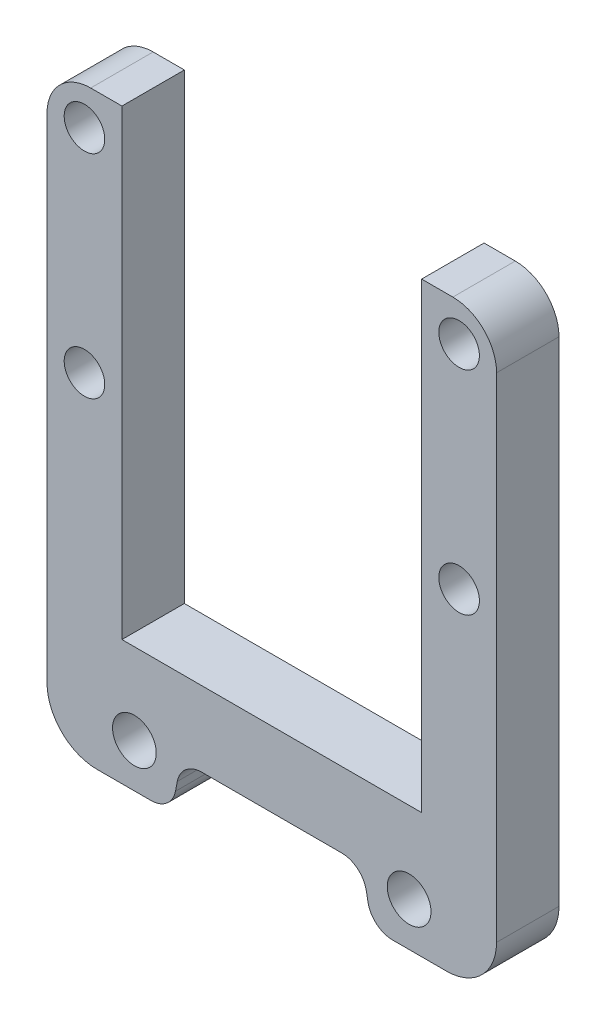
ISO-10303-21;
HEADER;
FILE_DESCRIPTION(('STEP AP214'),'2;1');
FILE_NAME('part.step','',(''),(''),'','','');
FILE_SCHEMA(('AUTOMOTIVE_DESIGN { 1 0 10303 214 1 1 1 1 }'));
ENDSEC;
DATA;
#1=APPLICATION_CONTEXT('core data for automotive mechanical design processes');
#2=APPLICATION_PROTOCOL_DEFINITION('international standard','automotive_design',2000,#1);
#3=PRODUCT_CONTEXT('',#1,'mechanical');
#4=PRODUCT('Part','Part','',(#3));
#5=PRODUCT_RELATED_PRODUCT_CATEGORY('part','',(#4));
#6=PRODUCT_DEFINITION_FORMATION('','',#4);
#7=PRODUCT_DEFINITION_CONTEXT('part definition',#1,'design');
#8=PRODUCT_DEFINITION('design','',#6,#7);
#9=PRODUCT_DEFINITION_SHAPE('','',#8);
#10=(LENGTH_UNIT() NAMED_UNIT(*) SI_UNIT(.MILLI.,.METRE.));
#11=(NAMED_UNIT(*) PLANE_ANGLE_UNIT() SI_UNIT($,.RADIAN.));
#12=(NAMED_UNIT(*) SI_UNIT($,.STERADIAN.) SOLID_ANGLE_UNIT());
#13=UNCERTAINTY_MEASURE_WITH_UNIT(LENGTH_MEASURE(1.E-05),#10,'distance_accuracy_value','');
#14=(GEOMETRIC_REPRESENTATION_CONTEXT(3) GLOBAL_UNCERTAINTY_ASSIGNED_CONTEXT((#13)) GLOBAL_UNIT_ASSIGNED_CONTEXT((#10,
#11,#12)) REPRESENTATION_CONTEXT('',''));
#15=CARTESIAN_POINT('',(0.,0.,0.));
#16=DIRECTION('',(0.,0.,1.));
#17=DIRECTION('',(1.,0.,0.));
#18=AXIS2_PLACEMENT_3D('',#15,#16,#17);
#19=CARTESIAN_POINT('',(0.,0.,10.));
#20=DIRECTION('',(0.,0.,1.));
#21=DIRECTION('',(1.,0.,0.));
#22=AXIS2_PLACEMENT_3D('',#19,#20,#21);
#23=PLANE('',#22);
#24=CARTESIAN_POINT('',(30.,104.,10.));
#25=DIRECTION('',(0.,0.,1.));
#26=DIRECTION('',(1.,0.,0.));
#27=AXIS2_PLACEMENT_3D('',#24,#25,#26);
#28=CIRCLE('',#27,3.24999999999999);
#29=CARTESIAN_POINT('',(33.25,104.,10.));
#30=VERTEX_POINT('',#29);
#31=EDGE_CURVE('E280',#30,#30,#28,.T.);
#32=ORIENTED_EDGE('',*,*,#31,.F.);
#33=EDGE_LOOP('',(#32));
#34=FACE_BOUND('',#33,.T.);
#35=DIRECTION('',(0.,1.,0.));
#36=VECTOR('',#35,1.);
#37=CARTESIAN_POINT('',(36.,16.,10.));
#38=LINE('',#37,#36);
#39=CARTESIAN_POINT('',(36.,24.,10.));
#40=VERTEX_POINT('',#39);
#41=CARTESIAN_POINT('',(36.,103.,10.));
#42=VERTEX_POINT('',#41);
#43=EDGE_CURVE('E316',#40,#42,#38,.T.);
#44=ORIENTED_EDGE('',*,*,#43,.T.);
#45=CARTESIAN_POINT('',(29.,103.,10.));
#46=DIRECTION('',(0.,0.,1.));
#47=DIRECTION('',(1.,0.,0.));
#48=AXIS2_PLACEMENT_3D('',#45,#46,#47);
#49=CIRCLE('',#48,7.);
#50=CARTESIAN_POINT('',(29.,110.,10.));
#51=VERTEX_POINT('',#50);
#52=EDGE_CURVE('E442',#42,#51,#49,.T.);
#53=ORIENTED_EDGE('',*,*,#52,.T.);
#54=DIRECTION('',(-1.,0.,0.));
#55=VECTOR('',#54,1.);
#56=CARTESIAN_POINT('',(36.,110.,10.));
#57=LINE('',#56,#55);
#58=CARTESIAN_POINT('',(24.,110.,10.));
#59=VERTEX_POINT('',#58);
#60=EDGE_CURVE('E296',#51,#59,#57,.T.);
#61=ORIENTED_EDGE('',*,*,#60,.T.);
#62=DIRECTION('',(0.,-1.,0.));
#63=VECTOR('',#62,1.);
#64=CARTESIAN_POINT('',(24.,110.,10.));
#65=LINE('',#64,#63);
#66=CARTESIAN_POINT('',(24.,36.,10.));
#67=VERTEX_POINT('',#66);
#68=EDGE_CURVE('E299',#59,#67,#65,.T.);
#69=ORIENTED_EDGE('',*,*,#68,.T.);
#70=DIRECTION('',(-1.,0.,0.));
#71=VECTOR('',#70,1.);
#72=CARTESIAN_POINT('',(24.,36.,10.));
#73=LINE('',#72,#71);
#74=CARTESIAN_POINT('',(-24.,36.,10.));
#75=VERTEX_POINT('',#74);
#76=EDGE_CURVE('E235',#67,#75,#73,.T.);
#77=ORIENTED_EDGE('',*,*,#76,.T.);
#78=DIRECTION('',(0.,-1.,0.));
#79=VECTOR('',#78,1.);
#80=CARTESIAN_POINT('',(-24.,110.,10.));
#81=LINE('',#80,#79);
#82=CARTESIAN_POINT('',(-24.,110.,10.));
#83=VERTEX_POINT('',#82);
#84=EDGE_CURVE('E219',#83,#75,#81,.T.);
#85=ORIENTED_EDGE('',*,*,#84,.F.);
#86=DIRECTION('',(1.,0.,0.));
#87=VECTOR('',#86,1.);
#88=CARTESIAN_POINT('',(-36.,110.,10.));
#89=LINE('',#88,#87);
#90=CARTESIAN_POINT('',(-29.,110.,10.));
#91=VERTEX_POINT('',#90);
#92=EDGE_CURVE('E213',#91,#83,#89,.T.);
#93=ORIENTED_EDGE('',*,*,#92,.F.);
#94=CARTESIAN_POINT('',(-29.,103.,10.));
#95=DIRECTION('',(0.,0.,1.));
#96=DIRECTION('',(1.,0.,0.));
#97=AXIS2_PLACEMENT_3D('',#94,#95,#96);
#98=CIRCLE('',#97,7.);
#99=CARTESIAN_POINT('',(-36.,103.,10.));
#100=VERTEX_POINT('',#99);
#101=EDGE_CURVE('E62',#91,#100,#98,.T.);
#102=ORIENTED_EDGE('',*,*,#101,.T.);
#103=DIRECTION('',(0.,1.,0.));
#104=VECTOR('',#103,1.);
#105=CARTESIAN_POINT('',(-36.,16.,10.));
#106=LINE('',#105,#104);
#107=CARTESIAN_POINT('',(-36.,24.,10.));
#108=VERTEX_POINT('',#107);
#109=EDGE_CURVE('E251',#108,#100,#106,.T.);
#110=ORIENTED_EDGE('',*,*,#109,.F.);
#111=CARTESIAN_POINT('',(-28.,24.,10.));
#112=DIRECTION('',(0.,0.,1.));
#113=DIRECTION('',(1.,0.,0.));
#114=AXIS2_PLACEMENT_3D('',#111,#112,#113);
#115=CIRCLE('',#114,8.);
#116=CARTESIAN_POINT('',(-28.,16.,10.));
#117=VERTEX_POINT('',#116);
#118=EDGE_CURVE('E418',#108,#117,#115,.T.);
#119=ORIENTED_EDGE('',*,*,#118,.T.);
#120=DIRECTION('',(-1.,0.,0.));
#121=VECTOR('',#120,1.);
#122=CARTESIAN_POINT('',(-16.0550424731017,16.,10.));
#123=LINE('',#122,#121);
#124=CARTESIAN_POINT('',(-19.3523880163717,16.,10.));
#125=VERTEX_POINT('',#124);
#126=EDGE_CURVE('E244',#125,#117,#123,.T.);
#127=ORIENTED_EDGE('',*,*,#126,.F.);
#128=CARTESIAN_POINT('',(-19.3523880163717,20.,10.));
#129=DIRECTION('',(0.,0.,1.));
#130=DIRECTION('',(1.,0.,0.));
#131=AXIS2_PLACEMENT_3D('',#128,#129,#130);
#132=CIRCLE('',#131,4.);
#133=CARTESIAN_POINT('',(-15.4258792825811,19.2367640184938,10.));
#134=VERTEX_POINT('',#133);
#135=EDGE_CURVE('E367',#125,#134,#132,.T.);
#136=ORIENTED_EDGE('',*,*,#135,.T.);
#137=DIRECTION('',(-0.190808995376542,-0.981627183447665,0.));
#138=VECTOR('',#137,1.);
#139=CARTESIAN_POINT('',(-14.5,24.,10.));
#140=LINE('',#139,#138);
#141=CARTESIAN_POINT('',(-15.1291631905207,20.7632359815062,10.));
#142=VERTEX_POINT('',#141);
#143=EDGE_CURVE('E238',#142,#134,#140,.T.);
#144=ORIENTED_EDGE('',*,*,#143,.F.);
#145=CARTESIAN_POINT('',(-11.20265445673,20.,10.));
#146=DIRECTION('',(0.,0.,1.));
#147=DIRECTION('',(1.,0.,0.));
#148=AXIS2_PLACEMENT_3D('',#145,#146,#147);
#149=CIRCLE('',#148,4.);
#150=CARTESIAN_POINT('',(-11.20265445673,24.,10.));
#151=VERTEX_POINT('',#150);
#152=EDGE_CURVE('E393',#142,#151,#149,.F.);
#153=ORIENTED_EDGE('',*,*,#152,.T.);
#154=DIRECTION('',(1.,0.,0.));
#155=VECTOR('',#154,1.);
#156=CARTESIAN_POINT('',(0.,24.,10.));
#157=LINE('',#156,#155);
#158=CARTESIAN_POINT('',(11.20265445673,24.,10.));
#159=VERTEX_POINT('',#158);
#160=EDGE_CURVE('E304',#151,#159,#157,.T.);
#161=ORIENTED_EDGE('',*,*,#160,.T.);
#162=CARTESIAN_POINT('',(11.20265445673,20.,10.));
#163=DIRECTION('',(0.,0.,1.));
#164=DIRECTION('',(1.,0.,0.));
#165=AXIS2_PLACEMENT_3D('',#162,#163,#164);
#166=CIRCLE('',#165,4.);
#167=CARTESIAN_POINT('',(15.1291631905207,20.7632359815062,10.));
#168=VERTEX_POINT('',#167);
#169=EDGE_CURVE('E399',#159,#168,#166,.F.);
#170=ORIENTED_EDGE('',*,*,#169,.T.);
#171=DIRECTION('',(0.190808995376542,-0.981627183447665,0.));
#172=VECTOR('',#171,1.);
#173=CARTESIAN_POINT('',(14.5,24.,10.));
#174=LINE('',#173,#172);
#175=CARTESIAN_POINT('',(15.4258792825811,19.2367640184938,10.));
#176=VERTEX_POINT('',#175);
#177=EDGE_CURVE('E308',#168,#176,#174,.T.);
#178=ORIENTED_EDGE('',*,*,#177,.T.);
#179=CARTESIAN_POINT('',(19.3523880163717,20.,10.));
#180=DIRECTION('',(0.,0.,1.));
#181=DIRECTION('',(1.,0.,0.));
#182=AXIS2_PLACEMENT_3D('',#179,#180,#181);
#183=CIRCLE('',#182,4.);
#184=CARTESIAN_POINT('',(19.3523880163717,16.,10.));
#185=VERTEX_POINT('',#184);
#186=EDGE_CURVE('E370',#176,#185,#183,.T.);
#187=ORIENTED_EDGE('',*,*,#186,.T.);
#188=DIRECTION('',(1.,0.,0.));
#189=VECTOR('',#188,1.);
#190=CARTESIAN_POINT('',(16.0550424731017,16.,10.));
#191=LINE('',#190,#189);
#192=CARTESIAN_POINT('',(28.,16.,10.));
#193=VERTEX_POINT('',#192);
#194=EDGE_CURVE('E312',#185,#193,#191,.T.);
#195=ORIENTED_EDGE('',*,*,#194,.T.);
#196=CARTESIAN_POINT('',(28.,24.,10.));
#197=DIRECTION('',(0.,0.,1.));
#198=DIRECTION('',(1.,0.,0.));
#199=AXIS2_PLACEMENT_3D('',#196,#197,#198);
#200=CIRCLE('',#199,8.);
#201=EDGE_CURVE('E415',#193,#40,#200,.T.);
#202=ORIENTED_EDGE('',*,*,#201,.T.);
#203=EDGE_LOOP('',(#44,#53,#61,#69,#77,#85,#93,#102,#110,#119,#127,#136,#144,#153,#161,#170,
#178,#187,#195,#202));
#204=FACE_BOUND('',#203,.T.);
#205=CARTESIAN_POINT('',(22.,23.,10.));
#206=DIRECTION('',(0.,0.,1.));
#207=DIRECTION('',(1.,0.,0.));
#208=AXIS2_PLACEMENT_3D('',#205,#206,#207);
#209=CIRCLE('',#208,3.5);
#210=CARTESIAN_POINT('',(25.5,23.,10.));
#211=VERTEX_POINT('',#210);
#212=EDGE_CURVE('E288',#211,#211,#209,.T.);
#213=ORIENTED_EDGE('',*,*,#212,.F.);
#214=EDGE_LOOP('',(#213));
#215=FACE_BOUND('',#214,.T.);
#216=CARTESIAN_POINT('',(30.,70.,10.));
#217=DIRECTION('',(0.,0.,1.));
#218=DIRECTION('',(1.,0.,0.));
#219=AXIS2_PLACEMENT_3D('',#216,#217,#218);
#220=CIRCLE('',#219,3.24999999999999);
#221=CARTESIAN_POINT('',(33.25,70.,10.));
#222=VERTEX_POINT('',#221);
#223=EDGE_CURVE('E272',#222,#222,#220,.T.);
#224=ORIENTED_EDGE('',*,*,#223,.F.);
#225=EDGE_LOOP('',(#224));
#226=FACE_BOUND('',#225,.T.);
#227=CARTESIAN_POINT('',(-30.,104.,10.));
#228=DIRECTION('',(0.,0.,-1.));
#229=DIRECTION('',(-1.,0.,0.));
#230=AXIS2_PLACEMENT_3D('',#227,#228,#229);
#231=CIRCLE('',#230,3.24999999999999);
#232=CARTESIAN_POINT('',(-33.25,104.,10.));
#233=VERTEX_POINT('',#232);
#234=EDGE_CURVE('E786',#233,#233,#231,.T.);
#235=ORIENTED_EDGE('',*,*,#234,.T.);
#236=EDGE_LOOP('',(#235));
#237=FACE_BOUND('',#236,.T.);
#238=CARTESIAN_POINT('',(-22.,23.,10.));
#239=DIRECTION('',(0.,0.,-1.));
#240=DIRECTION('',(-1.,0.,0.));
#241=AXIS2_PLACEMENT_3D('',#238,#239,#240);
#242=CIRCLE('',#241,3.5);
#243=CARTESIAN_POINT('',(-25.5,23.,10.));
#244=VERTEX_POINT('',#243);
#245=EDGE_CURVE('E257',#244,#244,#242,.T.);
#246=ORIENTED_EDGE('',*,*,#245,.T.);
#247=EDGE_LOOP('',(#246));
#248=FACE_BOUND('',#247,.T.);
#249=CARTESIAN_POINT('',(-30.,70.,10.));
#250=DIRECTION('',(0.,0.,-1.));
#251=DIRECTION('',(-1.,0.,0.));
#252=AXIS2_PLACEMENT_3D('',#249,#250,#251);
#253=CIRCLE('',#252,3.24999999999999);
#254=CARTESIAN_POINT('',(-33.25,70.,10.));
#255=VERTEX_POINT('',#254);
#256=EDGE_CURVE('E775',#255,#255,#253,.T.);
#257=ORIENTED_EDGE('',*,*,#256,.T.);
#258=EDGE_LOOP('',(#257));
#259=FACE_BOUND('',#258,.T.);
#260=ADVANCED_FACE('F41',(#34,#204,#215,#226,#237,#248,#259),#23,.T.);
#261=CARTESIAN_POINT('',(0.,0.,0.));
#262=DIRECTION('',(0.,0.,1.));
#263=DIRECTION('',(1.,0.,0.));
#264=AXIS2_PLACEMENT_3D('',#261,#262,#263);
#265=PLANE('',#264);
#266=DIRECTION('',(-1.,0.,0.));
#267=VECTOR('',#266,1.);
#268=CARTESIAN_POINT('',(36.,110.,0.));
#269=LINE('',#268,#267);
#270=CARTESIAN_POINT('',(29.,110.,0.));
#271=VERTEX_POINT('',#270);
#272=CARTESIAN_POINT('',(24.,110.,0.));
#273=VERTEX_POINT('',#272);
#274=EDGE_CURVE('E292',#271,#273,#269,.T.);
#275=ORIENTED_EDGE('',*,*,#274,.F.);
#276=CARTESIAN_POINT('',(29.,103.,0.));
#277=DIRECTION('',(0.,0.,1.));
#278=DIRECTION('',(1.,0.,0.));
#279=AXIS2_PLACEMENT_3D('',#276,#277,#278);
#280=CIRCLE('',#279,7.);
#281=CARTESIAN_POINT('',(36.,103.,0.));
#282=VERTEX_POINT('',#281);
#283=EDGE_CURVE('E435',#271,#282,#280,.F.);
#284=ORIENTED_EDGE('',*,*,#283,.T.);
#285=DIRECTION('',(0.,1.,0.));
#286=VECTOR('',#285,1.);
#287=CARTESIAN_POINT('',(36.,16.,0.));
#288=LINE('',#287,#286);
#289=CARTESIAN_POINT('',(36.,24.,0.));
#290=VERTEX_POINT('',#289);
#291=EDGE_CURVE('E300',#290,#282,#288,.T.);
#292=ORIENTED_EDGE('',*,*,#291,.F.);
#293=CARTESIAN_POINT('',(28.,24.,0.));
#294=DIRECTION('',(0.,0.,1.));
#295=DIRECTION('',(1.,0.,0.));
#296=AXIS2_PLACEMENT_3D('',#293,#294,#295);
#297=CIRCLE('',#296,8.);
#298=CARTESIAN_POINT('',(28.,16.,0.));
#299=VERTEX_POINT('',#298);
#300=EDGE_CURVE('E406',#290,#299,#297,.F.);
#301=ORIENTED_EDGE('',*,*,#300,.T.);
#302=DIRECTION('',(1.,0.,0.));
#303=VECTOR('',#302,1.);
#304=CARTESIAN_POINT('',(16.0550424731017,16.,0.));
#305=LINE('',#304,#303);
#306=CARTESIAN_POINT('',(19.3523880163717,16.,0.));
#307=VERTEX_POINT('',#306);
#308=EDGE_CURVE('E336',#307,#299,#305,.T.);
#309=ORIENTED_EDGE('',*,*,#308,.F.);
#310=CARTESIAN_POINT('',(19.3523880163717,20.,0.));
#311=DIRECTION('',(0.,0.,1.));
#312=DIRECTION('',(1.,0.,0.));
#313=AXIS2_PLACEMENT_3D('',#310,#311,#312);
#314=CIRCLE('',#313,4.);
#315=CARTESIAN_POINT('',(15.4258792825811,19.2367640184938,0.));
#316=VERTEX_POINT('',#315);
#317=EDGE_CURVE('E357',#307,#316,#314,.F.);
#318=ORIENTED_EDGE('',*,*,#317,.T.);
#319=DIRECTION('',(0.190808995376542,-0.981627183447665,0.));
#320=VECTOR('',#319,1.);
#321=CARTESIAN_POINT('',(14.5,24.,0.));
#322=LINE('',#321,#320);
#323=CARTESIAN_POINT('',(15.1291631905207,20.7632359815062,0.));
#324=VERTEX_POINT('',#323);
#325=EDGE_CURVE('E332',#324,#316,#322,.T.);
#326=ORIENTED_EDGE('',*,*,#325,.F.);
#327=CARTESIAN_POINT('',(11.20265445673,20.,0.));
#328=DIRECTION('',(0.,0.,1.));
#329=DIRECTION('',(1.,0.,0.));
#330=AXIS2_PLACEMENT_3D('',#327,#328,#329);
#331=CIRCLE('',#330,4.);
#332=CARTESIAN_POINT('',(11.20265445673,24.,0.));
#333=VERTEX_POINT('',#332);
#334=EDGE_CURVE('E396',#324,#333,#331,.T.);
#335=ORIENTED_EDGE('',*,*,#334,.T.);
#336=DIRECTION('',(1.,0.,0.));
#337=VECTOR('',#336,1.);
#338=CARTESIAN_POINT('',(0.,24.,0.));
#339=LINE('',#338,#337);
#340=CARTESIAN_POINT('',(-11.20265445673,24.,0.));
#341=VERTEX_POINT('',#340);
#342=EDGE_CURVE('E328',#341,#333,#339,.T.);
#343=ORIENTED_EDGE('',*,*,#342,.F.);
#344=CARTESIAN_POINT('',(-11.20265445673,20.,0.));
#345=DIRECTION('',(0.,0.,1.));
#346=DIRECTION('',(1.,0.,0.));
#347=AXIS2_PLACEMENT_3D('',#344,#345,#346);
#348=CIRCLE('',#347,4.);
#349=CARTESIAN_POINT('',(-15.1291631905207,20.7632359815062,0.));
#350=VERTEX_POINT('',#349);
#351=EDGE_CURVE('E390',#341,#350,#348,.T.);
#352=ORIENTED_EDGE('',*,*,#351,.T.);
#353=DIRECTION('',(-0.190808995376542,-0.981627183447665,0.));
#354=VECTOR('',#353,1.);
#355=CARTESIAN_POINT('',(-14.5,24.,0.));
#356=LINE('',#355,#354);
#357=CARTESIAN_POINT('',(-15.4258792825811,19.2367640184938,0.));
#358=VERTEX_POINT('',#357);
#359=EDGE_CURVE('E260',#350,#358,#356,.T.);
#360=ORIENTED_EDGE('',*,*,#359,.T.);
#361=CARTESIAN_POINT('',(-19.3523880163717,20.,0.));
#362=DIRECTION('',(0.,0.,1.));
#363=DIRECTION('',(1.,0.,0.));
#364=AXIS2_PLACEMENT_3D('',#361,#362,#363);
#365=CIRCLE('',#364,4.);
#366=CARTESIAN_POINT('',(-19.3523880163717,16.,0.));
#367=VERTEX_POINT('',#366);
#368=EDGE_CURVE('E354',#358,#367,#365,.F.);
#369=ORIENTED_EDGE('',*,*,#368,.T.);
#370=DIRECTION('',(-1.,0.,0.));
#371=VECTOR('',#370,1.);
#372=CARTESIAN_POINT('',(-16.0550424731017,16.,0.));
#373=LINE('',#372,#371);
#374=CARTESIAN_POINT('',(-28.,16.,0.));
#375=VERTEX_POINT('',#374);
#376=EDGE_CURVE('E264',#367,#375,#373,.T.);
#377=ORIENTED_EDGE('',*,*,#376,.T.);
#378=CARTESIAN_POINT('',(-28.,24.,0.));
#379=DIRECTION('',(0.,0.,1.));
#380=DIRECTION('',(1.,0.,0.));
#381=AXIS2_PLACEMENT_3D('',#378,#379,#380);
#382=CIRCLE('',#381,8.);
#383=CARTESIAN_POINT('',(-36.,24.,0.));
#384=VERTEX_POINT('',#383);
#385=EDGE_CURVE('E409',#375,#384,#382,.F.);
#386=ORIENTED_EDGE('',*,*,#385,.T.);
#387=DIRECTION('',(0.,1.,0.));
#388=VECTOR('',#387,1.);
#389=CARTESIAN_POINT('',(-36.,16.,0.));
#390=LINE('',#389,#388);
#391=CARTESIAN_POINT('',(-36.,103.,0.));
#392=VERTEX_POINT('',#391);
#393=EDGE_CURVE('E220',#384,#392,#390,.T.);
#394=ORIENTED_EDGE('',*,*,#393,.T.);
#395=CARTESIAN_POINT('',(-29.,103.,0.));
#396=DIRECTION('',(0.,0.,1.));
#397=DIRECTION('',(1.,0.,0.));
#398=AXIS2_PLACEMENT_3D('',#395,#396,#397);
#399=CIRCLE('',#398,7.);
#400=CARTESIAN_POINT('',(-29.,110.,0.));
#401=VERTEX_POINT('',#400);
#402=EDGE_CURVE('E432',#392,#401,#399,.F.);
#403=ORIENTED_EDGE('',*,*,#402,.T.);
#404=DIRECTION('',(1.,0.,0.));
#405=VECTOR('',#404,1.);
#406=CARTESIAN_POINT('',(-36.,110.,0.));
#407=LINE('',#406,#405);
#408=CARTESIAN_POINT('',(-24.,110.,0.));
#409=VERTEX_POINT('',#408);
#410=EDGE_CURVE('E254',#401,#409,#407,.T.);
#411=ORIENTED_EDGE('',*,*,#410,.T.);
#412=DIRECTION('',(0.,-1.,0.));
#413=VECTOR('',#412,1.);
#414=CARTESIAN_POINT('',(-24.,110.,0.));
#415=LINE('',#414,#413);
#416=CARTESIAN_POINT('',(-24.,36.,0.));
#417=VERTEX_POINT('',#416);
#418=EDGE_CURVE('E227',#409,#417,#415,.T.);
#419=ORIENTED_EDGE('',*,*,#418,.T.);
#420=DIRECTION('',(-1.,0.,0.));
#421=VECTOR('',#420,1.);
#422=CARTESIAN_POINT('',(24.,36.,0.));
#423=LINE('',#422,#421);
#424=CARTESIAN_POINT('',(24.,36.,0.));
#425=VERTEX_POINT('',#424);
#426=EDGE_CURVE('E325',#425,#417,#423,.T.);
#427=ORIENTED_EDGE('',*,*,#426,.F.);
#428=DIRECTION('',(0.,-1.,0.));
#429=VECTOR('',#428,1.);
#430=CARTESIAN_POINT('',(24.,110.,0.));
#431=LINE('',#430,#429);
#432=EDGE_CURVE('E322',#273,#425,#431,.T.);
#433=ORIENTED_EDGE('',*,*,#432,.F.);
#434=EDGE_LOOP('',(#275,#284,#292,#301,#309,#318,#326,#335,#343,#352,#360,#369,#377,#386,#394,
#403,#411,#419,#427,#433));
#435=FACE_BOUND('',#434,.T.);
#436=CARTESIAN_POINT('',(22.,23.,0.));
#437=DIRECTION('',(0.,0.,1.));
#438=DIRECTION('',(1.,0.,0.));
#439=AXIS2_PLACEMENT_3D('',#436,#437,#438);
#440=CIRCLE('',#439,3.5);
#441=CARTESIAN_POINT('',(25.5,23.,0.));
#442=VERTEX_POINT('',#441);
#443=EDGE_CURVE('E284',#442,#442,#440,.T.);
#444=ORIENTED_EDGE('',*,*,#443,.T.);
#445=EDGE_LOOP('',(#444));
#446=FACE_BOUND('',#445,.T.);
#447=CARTESIAN_POINT('',(30.,104.,0.));
#448=DIRECTION('',(0.,0.,1.));
#449=DIRECTION('',(1.,0.,0.));
#450=AXIS2_PLACEMENT_3D('',#447,#448,#449);
#451=CIRCLE('',#450,3.24999999999999);
#452=CARTESIAN_POINT('',(33.25,104.,0.));
#453=VERTEX_POINT('',#452);
#454=EDGE_CURVE('E276',#453,#453,#451,.T.);
#455=ORIENTED_EDGE('',*,*,#454,.T.);
#456=EDGE_LOOP('',(#455));
#457=FACE_BOUND('',#456,.T.);
#458=CARTESIAN_POINT('',(30.,70.,0.));
#459=DIRECTION('',(0.,0.,1.));
#460=DIRECTION('',(1.,0.,0.));
#461=AXIS2_PLACEMENT_3D('',#458,#459,#460);
#462=CIRCLE('',#461,3.24999999999999);
#463=CARTESIAN_POINT('',(33.25,70.,0.));
#464=VERTEX_POINT('',#463);
#465=EDGE_CURVE('E229',#464,#464,#462,.T.);
#466=ORIENTED_EDGE('',*,*,#465,.T.);
#467=EDGE_LOOP('',(#466));
#468=FACE_BOUND('',#467,.T.);
#469=CARTESIAN_POINT('',(-22.,23.,0.));
#470=DIRECTION('',(0.,0.,-1.));
#471=DIRECTION('',(-1.,0.,0.));
#472=AXIS2_PLACEMENT_3D('',#469,#470,#471);
#473=CIRCLE('',#472,3.5);
#474=CARTESIAN_POINT('',(-25.5,23.,0.));
#475=VERTEX_POINT('',#474);
#476=EDGE_CURVE('E789',#475,#475,#473,.T.);
#477=ORIENTED_EDGE('',*,*,#476,.F.);
#478=EDGE_LOOP('',(#477));
#479=FACE_BOUND('',#478,.T.);
#480=CARTESIAN_POINT('',(-30.,104.,0.));
#481=DIRECTION('',(0.,0.,-1.));
#482=DIRECTION('',(-1.,0.,0.));
#483=AXIS2_PLACEMENT_3D('',#480,#481,#482);
#484=CIRCLE('',#483,3.24999999999999);
#485=CARTESIAN_POINT('',(-33.25,104.,0.));
#486=VERTEX_POINT('',#485);
#487=EDGE_CURVE('E783',#486,#486,#484,.T.);
#488=ORIENTED_EDGE('',*,*,#487,.F.);
#489=EDGE_LOOP('',(#488));
#490=FACE_BOUND('',#489,.T.);
#491=CARTESIAN_POINT('',(-30.,70.,0.));
#492=DIRECTION('',(0.,0.,-1.));
#493=DIRECTION('',(-1.,0.,0.));
#494=AXIS2_PLACEMENT_3D('',#491,#492,#493);
#495=CIRCLE('',#494,3.24999999999999);
#496=CARTESIAN_POINT('',(-33.25,70.,0.));
#497=VERTEX_POINT('',#496);
#498=EDGE_CURVE('E778',#497,#497,#495,.T.);
#499=ORIENTED_EDGE('',*,*,#498,.F.);
#500=EDGE_LOOP('',(#499));
#501=FACE_BOUND('',#500,.T.);
#502=ADVANCED_FACE('F454',(#435,#446,#457,#468,#479,#490,#501),#265,.F.);
#503=CARTESIAN_POINT('',(36.,110.,10.));
#504=DIRECTION('',(0.,-1.,0.));
#505=DIRECTION('',(0.,0.,-1.));
#506=AXIS2_PLACEMENT_3D('',#503,#504,#505);
#507=PLANE('',#506);
#508=ORIENTED_EDGE('',*,*,#60,.F.);
#509=DIRECTION('',(0.,0.,-1.));
#510=VECTOR('',#509,1.);
#511=CARTESIAN_POINT('',(29.,110.,10.));
#512=LINE('',#511,#510);
#513=EDGE_CURVE('E428',#51,#271,#512,.T.);
#514=ORIENTED_EDGE('',*,*,#513,.T.);
#515=ORIENTED_EDGE('',*,*,#274,.T.);
#516=DIRECTION('',(0.,0.,-1.));
#517=VECTOR('',#516,1.);
#518=CARTESIAN_POINT('',(24.,110.,10.));
#519=LINE('',#518,#517);
#520=EDGE_CURVE('E346',#59,#273,#519,.T.);
#521=ORIENTED_EDGE('',*,*,#520,.F.);
#522=EDGE_LOOP('',(#508,#514,#515,#521));
#523=FACE_BOUND('',#522,.T.);
#524=ADVANCED_FACE('F517',(#523),#507,.F.);
#525=CARTESIAN_POINT('',(24.,110.,10.));
#526=DIRECTION('',(1.,0.,0.));
#527=DIRECTION('',(0.,1.,0.));
#528=AXIS2_PLACEMENT_3D('',#525,#526,#527);
#529=PLANE('',#528);
#530=ORIENTED_EDGE('',*,*,#432,.T.);
#531=DIRECTION('',(0.,0.,-1.));
#532=VECTOR('',#531,1.);
#533=CARTESIAN_POINT('',(24.,36.,10.));
#534=LINE('',#533,#532);
#535=EDGE_CURVE('E319',#67,#425,#534,.T.);
#536=ORIENTED_EDGE('',*,*,#535,.F.);
#537=ORIENTED_EDGE('',*,*,#68,.F.);
#538=ORIENTED_EDGE('',*,*,#520,.T.);
#539=EDGE_LOOP('',(#530,#536,#537,#538));
#540=FACE_BOUND('',#539,.T.);
#541=ADVANCED_FACE('F522',(#540),#529,.F.);
#542=CARTESIAN_POINT('',(24.,36.,10.));
#543=DIRECTION('',(0.,-1.,0.));
#544=DIRECTION('',(1.,0.,0.));
#545=AXIS2_PLACEMENT_3D('',#542,#543,#544);
#546=PLANE('',#545);
#547=ORIENTED_EDGE('',*,*,#426,.T.);
#548=DIRECTION('',(0.,0.,-1.));
#549=VECTOR('',#548,1.);
#550=CARTESIAN_POINT('',(-24.,36.,10.));
#551=LINE('',#550,#549);
#552=EDGE_CURVE('E230',#75,#417,#551,.T.);
#553=ORIENTED_EDGE('',*,*,#552,.F.);
#554=ORIENTED_EDGE('',*,*,#76,.F.);
#555=ORIENTED_EDGE('',*,*,#535,.T.);
#556=EDGE_LOOP('',(#547,#553,#554,#555));
#557=FACE_BOUND('',#556,.T.);
#558=ADVANCED_FACE('F525',(#557),#546,.F.);
#559=CARTESIAN_POINT('',(0.,24.,10.));
#560=DIRECTION('',(0.,1.,0.));
#561=DIRECTION('',(0.,0.,1.));
#562=AXIS2_PLACEMENT_3D('',#559,#560,#561);
#563=PLANE('',#562);
#564=ORIENTED_EDGE('',*,*,#160,.F.);
#565=DIRECTION('',(0.,0.,-1.));
#566=VECTOR('',#565,1.);
#567=CARTESIAN_POINT('',(-11.20265445673,24.,0.));
#568=LINE('',#567,#566);
#569=EDGE_CURVE('E386',#151,#341,#568,.T.);
#570=ORIENTED_EDGE('',*,*,#569,.T.);
#571=ORIENTED_EDGE('',*,*,#342,.T.);
#572=DIRECTION('',(0.,0.,-1.));
#573=VECTOR('',#572,1.);
#574=CARTESIAN_POINT('',(11.20265445673,24.,10.));
#575=LINE('',#574,#573);
#576=EDGE_CURVE('E383',#333,#159,#575,.F.);
#577=ORIENTED_EDGE('',*,*,#576,.T.);
#578=EDGE_LOOP('',(#564,#570,#571,#577));
#579=FACE_BOUND('',#578,.T.);
#580=ADVANCED_FACE('F481',(#579),#563,.F.);
#581=CARTESIAN_POINT('',(14.5,24.,10.));
#582=DIRECTION('',(0.981627183447665,0.190808995376542,0.));
#583=DIRECTION('',(-0.190808995376542,0.981627183447665,0.));
#584=AXIS2_PLACEMENT_3D('',#581,#582,#583);
#585=PLANE('',#584);
#586=ORIENTED_EDGE('',*,*,#325,.T.);
#587=DIRECTION('',(0.,0.,-1.));
#588=VECTOR('',#587,1.);
#589=CARTESIAN_POINT('',(15.4258792825811,19.2367640184938,10.));
#590=LINE('',#589,#588);
#591=EDGE_CURVE('E364',#316,#176,#590,.F.);
#592=ORIENTED_EDGE('',*,*,#591,.T.);
#593=ORIENTED_EDGE('',*,*,#177,.F.);
#594=DIRECTION('',(0.,0.,-1.));
#595=VECTOR('',#594,1.);
#596=CARTESIAN_POINT('',(15.1291631905207,20.7632359815062,0.));
#597=LINE('',#596,#595);
#598=EDGE_CURVE('E360',#168,#324,#597,.T.);
#599=ORIENTED_EDGE('',*,*,#598,.T.);
#600=EDGE_LOOP('',(#586,#592,#593,#599));
#601=FACE_BOUND('',#600,.T.);
#602=ADVANCED_FACE('F490',(#601),#585,.F.);
#603=CARTESIAN_POINT('',(16.0550424731017,16.,10.));
#604=DIRECTION('',(0.,1.,0.));
#605=DIRECTION('',(0.,0.,1.));
#606=AXIS2_PLACEMENT_3D('',#603,#604,#605);
#607=PLANE('',#606);
#608=ORIENTED_EDGE('',*,*,#308,.T.);
#609=DIRECTION('',(0.,0.,-1.));
#610=VECTOR('',#609,1.);
#611=CARTESIAN_POINT('',(28.,16.,10.));
#612=LINE('',#611,#610);
#613=EDGE_CURVE('E425',#299,#193,#612,.F.);
#614=ORIENTED_EDGE('',*,*,#613,.T.);
#615=ORIENTED_EDGE('',*,*,#194,.F.);
#616=DIRECTION('',(0.,0.,-1.));
#617=VECTOR('',#616,1.);
#618=CARTESIAN_POINT('',(19.3523880163717,16.,10.));
#619=LINE('',#618,#617);
#620=EDGE_CURVE('E350',#185,#307,#619,.T.);
#621=ORIENTED_EDGE('',*,*,#620,.T.);
#622=EDGE_LOOP('',(#608,#614,#615,#621));
#623=FACE_BOUND('',#622,.T.);
#624=ADVANCED_FACE('F499',(#623),#607,.F.);
#625=CARTESIAN_POINT('',(36.,16.,10.));
#626=DIRECTION('',(-1.,0.,0.));
#627=DIRECTION('',(0.,0.,1.));
#628=AXIS2_PLACEMENT_3D('',#625,#626,#627);
#629=PLANE('',#628);
#630=ORIENTED_EDGE('',*,*,#291,.T.);
#631=DIRECTION('',(0.,0.,-1.));
#632=VECTOR('',#631,1.);
#633=CARTESIAN_POINT('',(36.,103.,10.));
#634=LINE('',#633,#632);
#635=EDGE_CURVE('E438',#282,#42,#634,.F.);
#636=ORIENTED_EDGE('',*,*,#635,.T.);
#637=ORIENTED_EDGE('',*,*,#43,.F.);
#638=DIRECTION('',(0.,0.,-1.));
#639=VECTOR('',#638,1.);
#640=CARTESIAN_POINT('',(36.,24.,10.));
#641=LINE('',#640,#639);
#642=EDGE_CURVE('E421',#40,#290,#641,.T.);
#643=ORIENTED_EDGE('',*,*,#642,.T.);
#644=EDGE_LOOP('',(#630,#636,#637,#643));
#645=FACE_BOUND('',#644,.T.);
#646=ADVANCED_FACE('F508',(#645),#629,.F.);
#647=CARTESIAN_POINT('',(22.,23.,10.));
#648=DIRECTION('',(0.,0.,-1.));
#649=DIRECTION('',(-1.,0.,0.));
#650=AXIS2_PLACEMENT_3D('',#647,#648,#649);
#651=CYLINDRICAL_SURFACE('',#650,3.5);
#652=ORIENTED_EDGE('',*,*,#212,.T.);
#653=EDGE_LOOP('',(#652));
#654=FACE_BOUND('',#653,.T.);
#655=ORIENTED_EDGE('',*,*,#443,.F.);
#656=EDGE_LOOP('',(#655));
#657=FACE_BOUND('',#656,.T.);
#658=ADVANCED_FACE('F539',(#654,#657),#651,.F.);
#659=CARTESIAN_POINT('',(30.,104.,10.));
#660=DIRECTION('',(0.,0.,-1.));
#661=DIRECTION('',(-1.,0.,0.));
#662=AXIS2_PLACEMENT_3D('',#659,#660,#661);
#663=CYLINDRICAL_SURFACE('',#662,3.24999999999999);
#664=ORIENTED_EDGE('',*,*,#31,.T.);
#665=EDGE_LOOP('',(#664));
#666=FACE_BOUND('',#665,.T.);
#667=ORIENTED_EDGE('',*,*,#454,.F.);
#668=EDGE_LOOP('',(#667));
#669=FACE_BOUND('',#668,.T.);
#670=ADVANCED_FACE('F581',(#666,#669),#663,.F.);
#671=CARTESIAN_POINT('',(30.,70.,10.));
#672=DIRECTION('',(0.,0.,-1.));
#673=DIRECTION('',(-1.,0.,0.));
#674=AXIS2_PLACEMENT_3D('',#671,#672,#673);
#675=CYLINDRICAL_SURFACE('',#674,3.24999999999999);
#676=ORIENTED_EDGE('',*,*,#223,.T.);
#677=EDGE_LOOP('',(#676));
#678=FACE_BOUND('',#677,.T.);
#679=ORIENTED_EDGE('',*,*,#465,.F.);
#680=EDGE_LOOP('',(#679));
#681=FACE_BOUND('',#680,.T.);
#682=ADVANCED_FACE('F585',(#678,#681),#675,.F.);
#683=CARTESIAN_POINT('',(-36.,110.,10.));
#684=DIRECTION('',(0.,-1.,0.));
#685=DIRECTION('',(0.,0.,-1.));
#686=AXIS2_PLACEMENT_3D('',#683,#684,#685);
#687=PLANE('',#686);
#688=ORIENTED_EDGE('',*,*,#410,.F.);
#689=DIRECTION('',(0.,0.,-1.));
#690=VECTOR('',#689,1.);
#691=CARTESIAN_POINT('',(-29.,110.,10.));
#692=LINE('',#691,#690);
#693=EDGE_CURVE('E11',#401,#91,#692,.F.);
#694=ORIENTED_EDGE('',*,*,#693,.T.);
#695=ORIENTED_EDGE('',*,*,#92,.T.);
#696=DIRECTION('',(0.,0.,-1.));
#697=VECTOR('',#696,1.);
#698=CARTESIAN_POINT('',(-24.,110.,10.));
#699=LINE('',#698,#697);
#700=EDGE_CURVE('E216',#83,#409,#699,.T.);
#701=ORIENTED_EDGE('',*,*,#700,.T.);
#702=EDGE_LOOP('',(#688,#694,#695,#701));
#703=FACE_BOUND('',#702,.T.);
#704=ADVANCED_FACE('F215',(#703),#687,.F.);
#705=CARTESIAN_POINT('',(-24.,110.,10.));
#706=DIRECTION('',(-1.,0.,0.));
#707=DIRECTION('',(0.,1.,0.));
#708=AXIS2_PLACEMENT_3D('',#705,#706,#707);
#709=PLANE('',#708);
#710=ORIENTED_EDGE('',*,*,#418,.F.);
#711=ORIENTED_EDGE('',*,*,#700,.F.);
#712=ORIENTED_EDGE('',*,*,#84,.T.);
#713=ORIENTED_EDGE('',*,*,#552,.T.);
#714=EDGE_LOOP('',(#710,#711,#712,#713));
#715=FACE_BOUND('',#714,.T.);
#716=ADVANCED_FACE('F224',(#715),#709,.F.);
#717=CARTESIAN_POINT('',(-14.5,24.,10.));
#718=DIRECTION('',(-0.981627183447665,0.190808995376542,0.));
#719=DIRECTION('',(0.190808995376542,0.981627183447665,0.));
#720=AXIS2_PLACEMENT_3D('',#717,#718,#719);
#721=PLANE('',#720);
#722=ORIENTED_EDGE('',*,*,#143,.T.);
#723=DIRECTION('',(0.,0.,-1.));
#724=VECTOR('',#723,1.);
#725=CARTESIAN_POINT('',(-15.4258792825811,19.2367640184938,10.));
#726=LINE('',#725,#724);
#727=EDGE_CURVE('E376',#134,#358,#726,.T.);
#728=ORIENTED_EDGE('',*,*,#727,.T.);
#729=ORIENTED_EDGE('',*,*,#359,.F.);
#730=DIRECTION('',(0.,0.,-1.));
#731=VECTOR('',#730,1.);
#732=CARTESIAN_POINT('',(-15.1291631905207,20.7632359815062,10.));
#733=LINE('',#732,#731);
#734=EDGE_CURVE('E373',#350,#142,#733,.F.);
#735=ORIENTED_EDGE('',*,*,#734,.T.);
#736=EDGE_LOOP('',(#722,#728,#729,#735));
#737=FACE_BOUND('',#736,.T.);
#738=ADVANCED_FACE('F472',(#737),#721,.F.);
#739=CARTESIAN_POINT('',(-16.0550424731017,16.,10.));
#740=DIRECTION('',(0.,1.,0.));
#741=DIRECTION('',(0.,0.,1.));
#742=AXIS2_PLACEMENT_3D('',#739,#740,#741);
#743=PLANE('',#742);
#744=ORIENTED_EDGE('',*,*,#126,.T.);
#745=DIRECTION('',(0.,0.,-1.));
#746=VECTOR('',#745,1.);
#747=CARTESIAN_POINT('',(-28.,16.,10.));
#748=LINE('',#747,#746);
#749=EDGE_CURVE('E402',#117,#375,#748,.T.);
#750=ORIENTED_EDGE('',*,*,#749,.T.);
#751=ORIENTED_EDGE('',*,*,#376,.F.);
#752=DIRECTION('',(0.,0.,-1.));
#753=VECTOR('',#752,1.);
#754=CARTESIAN_POINT('',(-19.3523880163717,16.,10.));
#755=LINE('',#754,#753);
#756=EDGE_CURVE('E380',#367,#125,#755,.F.);
#757=ORIENTED_EDGE('',*,*,#756,.T.);
#758=EDGE_LOOP('',(#744,#750,#751,#757));
#759=FACE_BOUND('',#758,.T.);
#760=ADVANCED_FACE('F462',(#759),#743,.F.);
#761=CARTESIAN_POINT('',(-36.,16.,10.));
#762=DIRECTION('',(1.,0.,0.));
#763=DIRECTION('',(0.,0.,1.));
#764=AXIS2_PLACEMENT_3D('',#761,#762,#763);
#765=PLANE('',#764);
#766=ORIENTED_EDGE('',*,*,#109,.T.);
#767=DIRECTION('',(0.,0.,-1.));
#768=VECTOR('',#767,1.);
#769=CARTESIAN_POINT('',(-36.,103.,10.));
#770=LINE('',#769,#768);
#771=EDGE_CURVE('E50',#100,#392,#770,.T.);
#772=ORIENTED_EDGE('',*,*,#771,.T.);
#773=ORIENTED_EDGE('',*,*,#393,.F.);
#774=DIRECTION('',(0.,0.,-1.));
#775=VECTOR('',#774,1.);
#776=CARTESIAN_POINT('',(-36.,24.,10.));
#777=LINE('',#776,#775);
#778=EDGE_CURVE('E412',#384,#108,#777,.F.);
#779=ORIENTED_EDGE('',*,*,#778,.T.);
#780=EDGE_LOOP('',(#766,#772,#773,#779));
#781=FACE_BOUND('',#780,.T.);
#782=ADVANCED_FACE('F449',(#781),#765,.F.);
#783=CARTESIAN_POINT('',(-22.,23.,10.));
#784=DIRECTION('',(0.,0.,-1.));
#785=DIRECTION('',(1.,0.,0.));
#786=AXIS2_PLACEMENT_3D('',#783,#784,#785);
#787=CYLINDRICAL_SURFACE('',#786,3.5);
#788=ORIENTED_EDGE('',*,*,#245,.F.);
#789=EDGE_LOOP('',(#788));
#790=FACE_BOUND('',#789,.T.);
#791=ORIENTED_EDGE('',*,*,#476,.T.);
#792=EDGE_LOOP('',(#791));
#793=FACE_BOUND('',#792,.T.);
#794=ADVANCED_FACE('F675',(#790,#793),#787,.F.);
#795=CARTESIAN_POINT('',(-30.,104.,10.));
#796=DIRECTION('',(0.,0.,-1.));
#797=DIRECTION('',(1.,0.,0.));
#798=AXIS2_PLACEMENT_3D('',#795,#796,#797);
#799=CYLINDRICAL_SURFACE('',#798,3.24999999999999);
#800=ORIENTED_EDGE('',*,*,#234,.F.);
#801=EDGE_LOOP('',(#800));
#802=FACE_BOUND('',#801,.T.);
#803=ORIENTED_EDGE('',*,*,#487,.T.);
#804=EDGE_LOOP('',(#803));
#805=FACE_BOUND('',#804,.T.);
#806=ADVANCED_FACE('F682',(#802,#805),#799,.F.);
#807=CARTESIAN_POINT('',(-30.,70.,10.));
#808=DIRECTION('',(0.,0.,-1.));
#809=DIRECTION('',(1.,0.,0.));
#810=AXIS2_PLACEMENT_3D('',#807,#808,#809);
#811=CYLINDRICAL_SURFACE('',#810,3.24999999999999);
#812=ORIENTED_EDGE('',*,*,#256,.F.);
#813=EDGE_LOOP('',(#812));
#814=FACE_BOUND('',#813,.T.);
#815=ORIENTED_EDGE('',*,*,#498,.T.);
#816=EDGE_LOOP('',(#815));
#817=FACE_BOUND('',#816,.T.);
#818=ADVANCED_FACE('F558',(#814,#817),#811,.F.);
#819=CARTESIAN_POINT('',(19.3523880163717,20.,10.));
#820=DIRECTION('',(0.,0.,-1.));
#821=DIRECTION('',(-1.,0.,0.));
#822=AXIS2_PLACEMENT_3D('',#819,#820,#821);
#823=CYLINDRICAL_SURFACE('',#822,4.);
#824=ORIENTED_EDGE('',*,*,#186,.F.);
#825=ORIENTED_EDGE('',*,*,#591,.F.);
#826=ORIENTED_EDGE('',*,*,#317,.F.);
#827=ORIENTED_EDGE('',*,*,#620,.F.);
#828=EDGE_LOOP('',(#824,#825,#826,#827));
#829=FACE_BOUND('',#828,.T.);
#830=ADVANCED_FACE('F496',(#829),#823,.T.);
#831=CARTESIAN_POINT('',(-19.3523880163717,20.,10.));
#832=DIRECTION('',(0.,0.,-1.));
#833=DIRECTION('',(-1.,0.,0.));
#834=AXIS2_PLACEMENT_3D('',#831,#832,#833);
#835=CYLINDRICAL_SURFACE('',#834,4.);
#836=ORIENTED_EDGE('',*,*,#135,.F.);
#837=ORIENTED_EDGE('',*,*,#756,.F.);
#838=ORIENTED_EDGE('',*,*,#368,.F.);
#839=ORIENTED_EDGE('',*,*,#727,.F.);
#840=EDGE_LOOP('',(#836,#837,#838,#839));
#841=FACE_BOUND('',#840,.T.);
#842=ADVANCED_FACE('F469',(#841),#835,.T.);
#843=CARTESIAN_POINT('',(-11.20265445673,20.,10.));
#844=DIRECTION('',(0.,0.,1.));
#845=DIRECTION('',(1.,0.,0.));
#846=AXIS2_PLACEMENT_3D('',#843,#844,#845);
#847=CYLINDRICAL_SURFACE('',#846,4.);
#848=ORIENTED_EDGE('',*,*,#152,.F.);
#849=ORIENTED_EDGE('',*,*,#734,.F.);
#850=ORIENTED_EDGE('',*,*,#351,.F.);
#851=ORIENTED_EDGE('',*,*,#569,.F.);
#852=EDGE_LOOP('',(#848,#849,#850,#851));
#853=FACE_BOUND('',#852,.T.);
#854=ADVANCED_FACE('F478',(#853),#847,.F.);
#855=CARTESIAN_POINT('',(11.20265445673,20.,10.));
#856=DIRECTION('',(0.,0.,1.));
#857=DIRECTION('',(1.,0.,0.));
#858=AXIS2_PLACEMENT_3D('',#855,#856,#857);
#859=CYLINDRICAL_SURFACE('',#858,4.);
#860=ORIENTED_EDGE('',*,*,#169,.F.);
#861=ORIENTED_EDGE('',*,*,#576,.F.);
#862=ORIENTED_EDGE('',*,*,#334,.F.);
#863=ORIENTED_EDGE('',*,*,#598,.F.);
#864=EDGE_LOOP('',(#860,#861,#862,#863));
#865=FACE_BOUND('',#864,.T.);
#866=ADVANCED_FACE('F487',(#865),#859,.F.);
#867=CARTESIAN_POINT('',(-28.,24.,10.));
#868=DIRECTION('',(0.,0.,-1.));
#869=DIRECTION('',(-1.,0.,0.));
#870=AXIS2_PLACEMENT_3D('',#867,#868,#869);
#871=CYLINDRICAL_SURFACE('',#870,8.);
#872=ORIENTED_EDGE('',*,*,#118,.F.);
#873=ORIENTED_EDGE('',*,*,#778,.F.);
#874=ORIENTED_EDGE('',*,*,#385,.F.);
#875=ORIENTED_EDGE('',*,*,#749,.F.);
#876=EDGE_LOOP('',(#872,#873,#874,#875));
#877=FACE_BOUND('',#876,.T.);
#878=ADVANCED_FACE('F460',(#877),#871,.T.);
#879=CARTESIAN_POINT('',(28.,24.,10.));
#880=DIRECTION('',(0.,0.,-1.));
#881=DIRECTION('',(-1.,0.,0.));
#882=AXIS2_PLACEMENT_3D('',#879,#880,#881);
#883=CYLINDRICAL_SURFACE('',#882,8.);
#884=ORIENTED_EDGE('',*,*,#201,.F.);
#885=ORIENTED_EDGE('',*,*,#613,.F.);
#886=ORIENTED_EDGE('',*,*,#300,.F.);
#887=ORIENTED_EDGE('',*,*,#642,.F.);
#888=EDGE_LOOP('',(#884,#885,#886,#887));
#889=FACE_BOUND('',#888,.T.);
#890=ADVANCED_FACE('F505',(#889),#883,.T.);
#891=CARTESIAN_POINT('',(29.,103.,10.));
#892=DIRECTION('',(0.,0.,-1.));
#893=DIRECTION('',(-1.,0.,0.));
#894=AXIS2_PLACEMENT_3D('',#891,#892,#893);
#895=CYLINDRICAL_SURFACE('',#894,7.);
#896=ORIENTED_EDGE('',*,*,#52,.F.);
#897=ORIENTED_EDGE('',*,*,#635,.F.);
#898=ORIENTED_EDGE('',*,*,#283,.F.);
#899=ORIENTED_EDGE('',*,*,#513,.F.);
#900=EDGE_LOOP('',(#896,#897,#898,#899));
#901=FACE_BOUND('',#900,.T.);
#902=ADVANCED_FACE('F514',(#901),#895,.T.);
#903=CARTESIAN_POINT('',(-29.,103.,10.));
#904=DIRECTION('',(0.,0.,-1.));
#905=DIRECTION('',(-1.,0.,0.));
#906=AXIS2_PLACEMENT_3D('',#903,#904,#905);
#907=CYLINDRICAL_SURFACE('',#906,7.);
#908=ORIENTED_EDGE('',*,*,#101,.F.);
#909=ORIENTED_EDGE('',*,*,#693,.F.);
#910=ORIENTED_EDGE('',*,*,#402,.F.);
#911=ORIENTED_EDGE('',*,*,#771,.F.);
#912=EDGE_LOOP('',(#908,#909,#910,#911));
#913=FACE_BOUND('',#912,.T.);
#914=ADVANCED_FACE('F43',(#913),#907,.T.);
#915=CLOSED_SHELL('',(#260,#502,#524,#541,#558,#580,#602,#624,#646,#658,#670,#682,#704,#716,
#738,#760,#782,#794,#806,#818,#830,#842,#854,#866,#878,#890,#902,#914));
#916=MANIFOLD_SOLID_BREP('B2',#915);
#917=ADVANCED_BREP_SHAPE_REPRESENTATION('',(#18,#916),#14);
#918=SHAPE_DEFINITION_REPRESENTATION(#9,#917);
ENDSEC;
END-ISO-10303-21;
